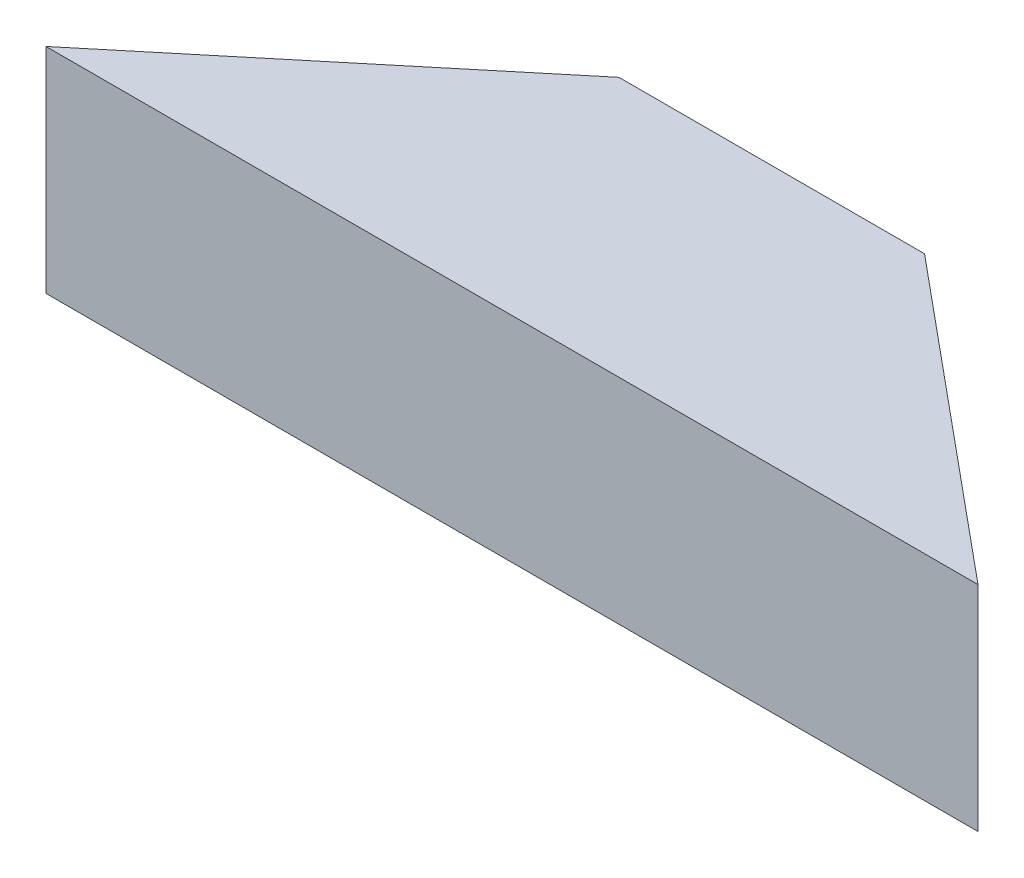
ISO-10303-21;
HEADER;
FILE_DESCRIPTION(('STEP AP214'),'2;1');
FILE_NAME('part.step','',(''),(''),'','','');
FILE_SCHEMA(('AUTOMOTIVE_DESIGN { 1 0 10303 214 1 1 1 1 }'));
ENDSEC;
DATA;
#1=APPLICATION_CONTEXT('core data for automotive mechanical design processes');
#2=APPLICATION_PROTOCOL_DEFINITION('international standard','automotive_design',2000,#1);
#3=PRODUCT_CONTEXT('',#1,'mechanical');
#4=PRODUCT('Part','Part','',(#3));
#5=PRODUCT_RELATED_PRODUCT_CATEGORY('part','',(#4));
#6=PRODUCT_DEFINITION_FORMATION('','',#4);
#7=PRODUCT_DEFINITION_CONTEXT('part definition',#1,'design');
#8=PRODUCT_DEFINITION('design','',#6,#7);
#9=PRODUCT_DEFINITION_SHAPE('','',#8);
#10=(LENGTH_UNIT() NAMED_UNIT(*) SI_UNIT(.MILLI.,.METRE.));
#11=(NAMED_UNIT(*) PLANE_ANGLE_UNIT() SI_UNIT($,.RADIAN.));
#12=(NAMED_UNIT(*) SI_UNIT($,.STERADIAN.) SOLID_ANGLE_UNIT());
#13=UNCERTAINTY_MEASURE_WITH_UNIT(LENGTH_MEASURE(1.E-05),#10,'distance_accuracy_value','');
#14=(GEOMETRIC_REPRESENTATION_CONTEXT(3) GLOBAL_UNCERTAINTY_ASSIGNED_CONTEXT((#13)) GLOBAL_UNIT_ASSIGNED_CONTEXT((#10,
#11,#12)) REPRESENTATION_CONTEXT('',''));
#15=CARTESIAN_POINT('',(0.,0.,0.));
#16=DIRECTION('',(0.,0.,1.));
#17=DIRECTION('',(1.,0.,0.));
#18=AXIS2_PLACEMENT_3D('',#15,#16,#17);
#19=CARTESIAN_POINT('',(4.1,2.8,-3.4));
#20=DIRECTION('',(0.638335869594524,0.,0.769757960393397));
#21=DIRECTION('',(0.769757960393397,0.,-0.638335869594524));
#22=AXIS2_PLACEMENT_3D('',#19,#20,#21);
#23=PLANE('',#22);
#24=DIRECTION('',(-0.769757960393397,0.,0.638335869594524));
#25=VECTOR('',#24,1.);
#26=CARTESIAN_POINT('',(4.1,0.,-3.4));
#27=LINE('',#26,#25);
#28=CARTESIAN_POINT('',(4.1,0.,-3.4));
#29=VERTEX_POINT('',#28);
#30=CARTESIAN_POINT('',(0.,0.,0.));
#31=VERTEX_POINT('',#30);
#32=EDGE_CURVE('E96',#29,#31,#27,.T.);
#33=ORIENTED_EDGE('',*,*,#32,.T.);
#34=DIRECTION('',(0.,-1.,0.));
#35=VECTOR('',#34,1.);
#36=CARTESIAN_POINT('',(0.,2.8,0.));
#37=LINE('',#36,#35);
#38=CARTESIAN_POINT('',(0.,2.8,0.));
#39=VERTEX_POINT('',#38);
#40=EDGE_CURVE('E11',#39,#31,#37,.T.);
#41=ORIENTED_EDGE('',*,*,#40,.F.);
#42=DIRECTION('',(-0.769757960393397,0.,0.638335869594524));
#43=VECTOR('',#42,1.);
#44=CARTESIAN_POINT('',(4.1,2.8,-3.4));
#45=LINE('',#44,#43);
#46=CARTESIAN_POINT('',(4.1,2.8,-3.4));
#47=VERTEX_POINT('',#46);
#48=EDGE_CURVE('E84',#47,#39,#45,.T.);
#49=ORIENTED_EDGE('',*,*,#48,.F.);
#50=DIRECTION('',(0.,-1.,0.));
#51=VECTOR('',#50,1.);
#52=CARTESIAN_POINT('',(4.1,2.8,-3.4));
#53=LINE('',#52,#51);
#54=EDGE_CURVE('E92',#47,#29,#53,.T.);
#55=ORIENTED_EDGE('',*,*,#54,.T.);
#56=EDGE_LOOP('',(#33,#41,#49,#55));
#57=FACE_BOUND('',#56,.T.);
#58=ADVANCED_FACE('F33',(#57),#23,.F.);
#59=CARTESIAN_POINT('',(0.,2.8,0.));
#60=DIRECTION('',(0.,0.,-1.));
#61=DIRECTION('',(-1.,0.,0.));
#62=AXIS2_PLACEMENT_3D('',#59,#60,#61);
#63=PLANE('',#62);
#64=DIRECTION('',(1.,0.,0.));
#65=VECTOR('',#64,1.);
#66=CARTESIAN_POINT('',(0.,0.,0.));
#67=LINE('',#66,#65);
#68=CARTESIAN_POINT('',(12.2,0.,0.));
#69=VERTEX_POINT('',#68);
#70=EDGE_CURVE('E88',#31,#69,#67,.T.);
#71=ORIENTED_EDGE('',*,*,#70,.T.);
#72=DIRECTION('',(0.,-1.,0.));
#73=VECTOR('',#72,1.);
#74=CARTESIAN_POINT('',(12.2,2.8,0.));
#75=LINE('',#74,#73);
#76=CARTESIAN_POINT('',(12.2,2.8,0.));
#77=VERTEX_POINT('',#76);
#78=EDGE_CURVE('E41',#77,#69,#75,.T.);
#79=ORIENTED_EDGE('',*,*,#78,.F.);
#80=DIRECTION('',(1.,0.,0.));
#81=VECTOR('',#80,1.);
#82=CARTESIAN_POINT('',(0.,2.8,0.));
#83=LINE('',#82,#81);
#84=EDGE_CURVE('E79',#39,#77,#83,.T.);
#85=ORIENTED_EDGE('',*,*,#84,.F.);
#86=ORIENTED_EDGE('',*,*,#40,.T.);
#87=EDGE_LOOP('',(#71,#79,#85,#86));
#88=FACE_BOUND('',#87,.T.);
#89=ADVANCED_FACE('F87',(#88),#63,.F.);
#90=CARTESIAN_POINT('',(12.2,2.8,0.));
#91=DIRECTION('',(-0.638335869594524,0.,0.769757960393397));
#92=DIRECTION('',(0.769757960393397,0.,0.638335869594524));
#93=AXIS2_PLACEMENT_3D('',#90,#91,#92);
#94=PLANE('',#93);
#95=DIRECTION('',(-0.769757960393397,0.,-0.638335869594524));
#96=VECTOR('',#95,1.);
#97=CARTESIAN_POINT('',(12.2,0.,0.));
#98=LINE('',#97,#96);
#99=CARTESIAN_POINT('',(8.1,0.,-3.4));
#100=VERTEX_POINT('',#99);
#101=EDGE_CURVE('E66',#69,#100,#98,.T.);
#102=ORIENTED_EDGE('',*,*,#101,.T.);
#103=DIRECTION('',(0.,-1.,0.));
#104=VECTOR('',#103,1.);
#105=CARTESIAN_POINT('',(8.1,2.8,-3.4));
#106=LINE('',#105,#104);
#107=CARTESIAN_POINT('',(8.1,2.8,-3.4));
#108=VERTEX_POINT('',#107);
#109=EDGE_CURVE('E89',#108,#100,#106,.T.);
#110=ORIENTED_EDGE('',*,*,#109,.F.);
#111=DIRECTION('',(-0.769757960393397,0.,-0.638335869594524));
#112=VECTOR('',#111,1.);
#113=CARTESIAN_POINT('',(12.2,2.8,0.));
#114=LINE('',#113,#112);
#115=EDGE_CURVE('E82',#77,#108,#114,.T.);
#116=ORIENTED_EDGE('',*,*,#115,.F.);
#117=ORIENTED_EDGE('',*,*,#78,.T.);
#118=EDGE_LOOP('',(#102,#110,#116,#117));
#119=FACE_BOUND('',#118,.T.);
#120=ADVANCED_FACE('F90',(#119),#94,.F.);
#121=CARTESIAN_POINT('',(8.1,2.8,-3.4));
#122=DIRECTION('',(0.,0.,1.));
#123=DIRECTION('',(1.,0.,0.));
#124=AXIS2_PLACEMENT_3D('',#121,#122,#123);
#125=PLANE('',#124);
#126=DIRECTION('',(-1.,0.,0.));
#127=VECTOR('',#126,1.);
#128=CARTESIAN_POINT('',(8.1,0.,-3.4));
#129=LINE('',#128,#127);
#130=EDGE_CURVE('E72',#100,#29,#129,.T.);
#131=ORIENTED_EDGE('',*,*,#130,.T.);
#132=ORIENTED_EDGE('',*,*,#54,.F.);
#133=DIRECTION('',(-1.,0.,0.));
#134=VECTOR('',#133,1.);
#135=CARTESIAN_POINT('',(8.1,2.8,-3.4));
#136=LINE('',#135,#134);
#137=EDGE_CURVE('E49',#108,#47,#136,.T.);
#138=ORIENTED_EDGE('',*,*,#137,.F.);
#139=ORIENTED_EDGE('',*,*,#109,.T.);
#140=EDGE_LOOP('',(#131,#132,#138,#139));
#141=FACE_BOUND('',#140,.T.);
#142=ADVANCED_FACE('F103',(#141),#125,.F.);
#143=CARTESIAN_POINT('',(0.,2.8,0.));
#144=DIRECTION('',(0.,-1.,0.));
#145=DIRECTION('',(0.,0.,-1.));
#146=AXIS2_PLACEMENT_3D('',#143,#144,#145);
#147=PLANE('',#146);
#148=ORIENTED_EDGE('',*,*,#48,.T.);
#149=ORIENTED_EDGE('',*,*,#84,.T.);
#150=ORIENTED_EDGE('',*,*,#115,.T.);
#151=ORIENTED_EDGE('',*,*,#137,.T.);
#152=EDGE_LOOP('',(#148,#149,#150,#151));
#153=FACE_BOUND('',#152,.T.);
#154=ADVANCED_FACE('F80',(#153),#147,.F.);
#155=CARTESIAN_POINT('',(0.,0.,0.));
#156=DIRECTION('',(0.,-1.,0.));
#157=DIRECTION('',(0.,0.,-1.));
#158=AXIS2_PLACEMENT_3D('',#155,#156,#157);
#159=PLANE('',#158);
#160=ORIENTED_EDGE('',*,*,#32,.F.);
#161=ORIENTED_EDGE('',*,*,#130,.F.);
#162=ORIENTED_EDGE('',*,*,#101,.F.);
#163=ORIENTED_EDGE('',*,*,#70,.F.);
#164=EDGE_LOOP('',(#160,#161,#162,#163));
#165=FACE_BOUND('',#164,.T.);
#166=ADVANCED_FACE('F106',(#165),#159,.T.);
#167=CLOSED_SHELL('',(#58,#89,#120,#142,#154,#166));
#168=MANIFOLD_SOLID_BREP('B2',#167);
#169=ADVANCED_BREP_SHAPE_REPRESENTATION('',(#18,#168),#14);
#170=SHAPE_DEFINITION_REPRESENTATION(#9,#169);
ENDSEC;
END-ISO-10303-21;
